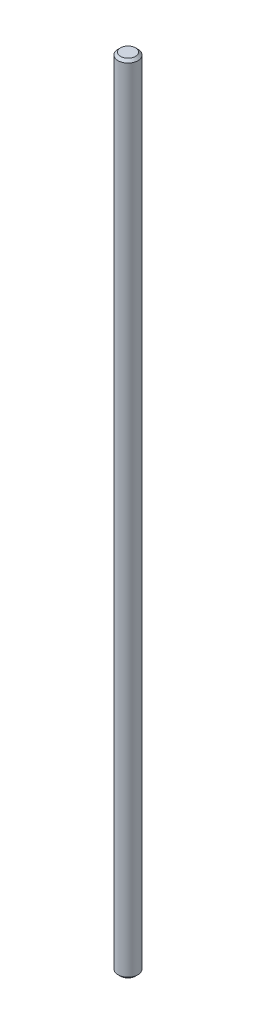
ISO-10303-21;
HEADER;
FILE_DESCRIPTION(('STEP AP214'),'2;1');
FILE_NAME('part.step','',(''),(''),'','','');
FILE_SCHEMA(('AUTOMOTIVE_DESIGN { 1 0 10303 214 1 1 1 1 }'));
ENDSEC;
DATA;
#1=APPLICATION_CONTEXT('core data for automotive mechanical design processes');
#2=APPLICATION_PROTOCOL_DEFINITION('international standard','automotive_design',2000,#1);
#3=PRODUCT_CONTEXT('',#1,'mechanical');
#4=PRODUCT('Part','Part','',(#3));
#5=PRODUCT_RELATED_PRODUCT_CATEGORY('part','',(#4));
#6=PRODUCT_DEFINITION_FORMATION('','',#4);
#7=PRODUCT_DEFINITION_CONTEXT('part definition',#1,'design');
#8=PRODUCT_DEFINITION('design','',#6,#7);
#9=PRODUCT_DEFINITION_SHAPE('','',#8);
#10=(LENGTH_UNIT() NAMED_UNIT(*) SI_UNIT(.MILLI.,.METRE.));
#11=(NAMED_UNIT(*) PLANE_ANGLE_UNIT() SI_UNIT($,.RADIAN.));
#12=(NAMED_UNIT(*) SI_UNIT($,.STERADIAN.) SOLID_ANGLE_UNIT());
#13=UNCERTAINTY_MEASURE_WITH_UNIT(LENGTH_MEASURE(1.E-05),#10,'distance_accuracy_value','');
#14=(GEOMETRIC_REPRESENTATION_CONTEXT(3) GLOBAL_UNCERTAINTY_ASSIGNED_CONTEXT((#13)) GLOBAL_UNIT_ASSIGNED_CONTEXT((#10,
#11,#12)) REPRESENTATION_CONTEXT('',''));
#15=CARTESIAN_POINT('',(0.,0.,0.));
#16=DIRECTION('',(0.,0.,1.));
#17=DIRECTION('',(1.,0.,0.));
#18=AXIS2_PLACEMENT_3D('',#15,#16,#17);
#19=CARTESIAN_POINT('',(0.,160.,0.));
#20=DIRECTION('',(0.,-1.,0.));
#21=DIRECTION('',(0.,0.,-1.));
#22=AXIS2_PLACEMENT_3D('',#19,#20,#21);
#23=CYLINDRICAL_SURFACE('',#22,2.);
#24=CARTESIAN_POINT('',(0.,0.499999999999973,0.));
#25=DIRECTION('',(0.,1.,0.));
#26=DIRECTION('',(0.,0.,1.));
#27=AXIS2_PLACEMENT_3D('',#24,#25,#26);
#28=CIRCLE('',#27,2.);
#29=CARTESIAN_POINT('',(0.,0.499999999999973,2.));
#30=VERTEX_POINT('',#29);
#31=EDGE_CURVE('E45',#30,#30,#28,.T.);
#32=ORIENTED_EDGE('',*,*,#31,.T.);
#33=EDGE_LOOP('',(#32));
#34=FACE_BOUND('',#33,.T.);
#35=CARTESIAN_POINT('',(0.,159.5,0.));
#36=DIRECTION('',(0.,1.,0.));
#37=DIRECTION('',(0.,0.,1.));
#38=AXIS2_PLACEMENT_3D('',#35,#36,#37);
#39=CIRCLE('',#38,2.);
#40=CARTESIAN_POINT('',(0.,159.5,2.));
#41=VERTEX_POINT('',#40);
#42=EDGE_CURVE('E49',#41,#41,#39,.F.);
#43=ORIENTED_EDGE('',*,*,#42,.T.);
#44=EDGE_LOOP('',(#43));
#45=FACE_BOUND('',#44,.T.);
#46=ADVANCED_FACE('F33',(#34,#45),#23,.T.);
#47=CARTESIAN_POINT('',(0.,160.,0.));
#48=DIRECTION('',(0.,1.,0.));
#49=DIRECTION('',(0.,0.,1.));
#50=AXIS2_PLACEMENT_3D('',#47,#48,#49);
#51=PLANE('',#50);
#52=CARTESIAN_POINT('',(0.,160.,0.));
#53=DIRECTION('',(0.,1.,0.));
#54=DIRECTION('',(0.,0.,1.));
#55=AXIS2_PLACEMENT_3D('',#52,#53,#54);
#56=CIRCLE('',#55,1.5);
#57=CARTESIAN_POINT('',(0.,160.,1.5));
#58=VERTEX_POINT('',#57);
#59=EDGE_CURVE('E10',#58,#58,#56,.T.);
#60=ORIENTED_EDGE('',*,*,#59,.T.);
#61=EDGE_LOOP('',(#60));
#62=FACE_BOUND('',#61,.T.);
#63=ADVANCED_FACE('F65',(#62),#51,.T.);
#64=CARTESIAN_POINT('',(0.,0.,0.));
#65=DIRECTION('',(0.,1.,0.));
#66=DIRECTION('',(0.,0.,1.));
#67=AXIS2_PLACEMENT_3D('',#64,#65,#66);
#68=PLANE('',#67);
#69=CARTESIAN_POINT('',(0.,0.,0.));
#70=DIRECTION('',(0.,1.,0.));
#71=DIRECTION('',(0.,0.,1.));
#72=AXIS2_PLACEMENT_3D('',#69,#70,#71);
#73=CIRCLE('',#72,1.50000000000002);
#74=CARTESIAN_POINT('',(0.,0.,1.50000000000002));
#75=VERTEX_POINT('',#74);
#76=EDGE_CURVE('E41',#75,#75,#73,.F.);
#77=ORIENTED_EDGE('',*,*,#76,.T.);
#78=EDGE_LOOP('',(#77));
#79=FACE_BOUND('',#78,.T.);
#80=ADVANCED_FACE('F62',(#79),#68,.F.);
#81=CARTESIAN_POINT('',(0.,0.499999999999973,0.));
#82=DIRECTION('',(0.,1.,0.));
#83=DIRECTION('',(0.,0.,1.));
#84=AXIS2_PLACEMENT_3D('',#81,#82,#83);
#85=CONICAL_SURFACE('',#84,2.,0.78539816339746);
#86=ORIENTED_EDGE('',*,*,#76,.F.);
#87=EDGE_LOOP('',(#86));
#88=FACE_BOUND('',#87,.T.);
#89=ORIENTED_EDGE('',*,*,#31,.F.);
#90=EDGE_LOOP('',(#89));
#91=FACE_BOUND('',#90,.T.);
#92=ADVANCED_FACE('F58',(#88,#91),#85,.T.);
#93=CARTESIAN_POINT('',(0.,160.,0.));
#94=DIRECTION('',(0.,-1.,0.));
#95=DIRECTION('',(0.,0.,-1.));
#96=AXIS2_PLACEMENT_3D('',#93,#94,#95);
#97=CONICAL_SURFACE('',#96,1.5,0.785398163397419);
#98=ORIENTED_EDGE('',*,*,#42,.F.);
#99=EDGE_LOOP('',(#98));
#100=FACE_BOUND('',#99,.T.);
#101=ORIENTED_EDGE('',*,*,#59,.F.);
#102=EDGE_LOOP('',(#101));
#103=FACE_BOUND('',#102,.T.);
#104=ADVANCED_FACE('F36',(#100,#103),#97,.T.);
#105=CLOSED_SHELL('',(#46,#63,#80,#92,#104));
#106=MANIFOLD_SOLID_BREP('B2',#105);
#107=ADVANCED_BREP_SHAPE_REPRESENTATION('',(#18,#106),#14);
#108=SHAPE_DEFINITION_REPRESENTATION(#9,#107);
ENDSEC;
END-ISO-10303-21;
